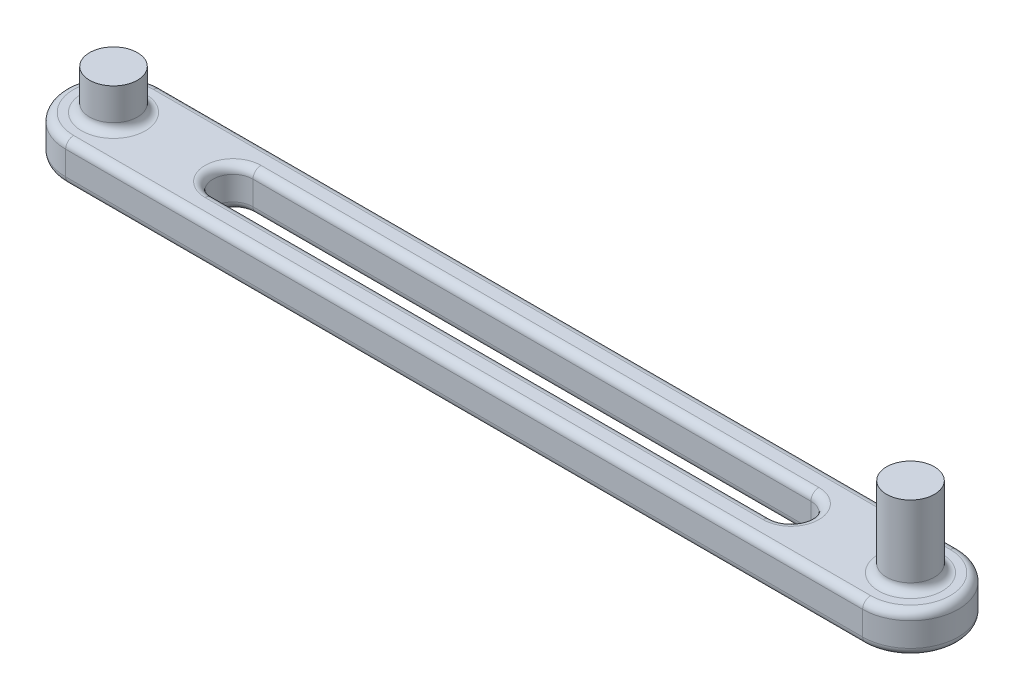
ISO-10303-21;
HEADER;
FILE_DESCRIPTION(('STEP AP214'),'2;1');
FILE_NAME('part.step','',(''),(''),'','','');
FILE_SCHEMA(('AUTOMOTIVE_DESIGN { 1 0 10303 214 1 1 1 1 }'));
ENDSEC;
DATA;
#1=APPLICATION_CONTEXT('core data for automotive mechanical design processes');
#2=APPLICATION_PROTOCOL_DEFINITION('international standard','automotive_design',2000,#1);
#3=PRODUCT_CONTEXT('',#1,'mechanical');
#4=PRODUCT('Part','Part','',(#3));
#5=PRODUCT_RELATED_PRODUCT_CATEGORY('part','',(#4));
#6=PRODUCT_DEFINITION_FORMATION('','',#4);
#7=PRODUCT_DEFINITION_CONTEXT('part definition',#1,'design');
#8=PRODUCT_DEFINITION('design','',#6,#7);
#9=PRODUCT_DEFINITION_SHAPE('','',#8);
#10=(LENGTH_UNIT() NAMED_UNIT(*) SI_UNIT(.MILLI.,.METRE.));
#11=(NAMED_UNIT(*) PLANE_ANGLE_UNIT() SI_UNIT($,.RADIAN.));
#12=(NAMED_UNIT(*) SI_UNIT($,.STERADIAN.) SOLID_ANGLE_UNIT());
#13=UNCERTAINTY_MEASURE_WITH_UNIT(LENGTH_MEASURE(1.E-05),#10,'distance_accuracy_value','');
#14=(GEOMETRIC_REPRESENTATION_CONTEXT(3) GLOBAL_UNCERTAINTY_ASSIGNED_CONTEXT((#13)) GLOBAL_UNIT_ASSIGNED_CONTEXT((#10,
#11,#12)) REPRESENTATION_CONTEXT('',''));
#15=CARTESIAN_POINT('',(0.,0.,0.));
#16=DIRECTION('',(0.,0.,1.));
#17=DIRECTION('',(1.,0.,0.));
#18=AXIS2_PLACEMENT_3D('',#15,#16,#17);
#19=CARTESIAN_POINT('',(-35.,0.,0.));
#20=DIRECTION('',(0.,1.,0.));
#21=DIRECTION('',(0.,0.,1.));
#22=AXIS2_PLACEMENT_3D('',#19,#20,#21);
#23=CYLINDRICAL_SURFACE('',#22,2.5);
#24=DIRECTION('',(0.,1.,0.));
#25=VECTOR('',#24,1.);
#26=CARTESIAN_POINT('',(-35.,0.,2.5));
#27=LINE('',#26,#25);
#28=CARTESIAN_POINT('',(-35.,1.,2.5));
#29=VERTEX_POINT('',#28);
#30=CARTESIAN_POINT('',(-35.,4.,2.5));
#31=VERTEX_POINT('',#30);
#32=EDGE_CURVE('E324',#29,#31,#27,.T.);
#33=ORIENTED_EDGE('',*,*,#32,.F.);
#34=CARTESIAN_POINT('',(-35.,1.,0.));
#35=DIRECTION('',(0.,1.,0.));
#36=DIRECTION('',(0.,0.,1.));
#37=AXIS2_PLACEMENT_3D('',#34,#35,#36);
#38=CIRCLE('',#37,2.5);
#39=CARTESIAN_POINT('',(-35.,1.,-2.5));
#40=VERTEX_POINT('',#39);
#41=EDGE_CURVE('E301',#29,#40,#38,.F.);
#42=ORIENTED_EDGE('',*,*,#41,.T.);
#43=DIRECTION('',(0.,1.,0.));
#44=VECTOR('',#43,1.);
#45=CARTESIAN_POINT('',(-35.,0.,-2.5));
#46=LINE('',#45,#44);
#47=CARTESIAN_POINT('',(-35.,4.,-2.5));
#48=VERTEX_POINT('',#47);
#49=EDGE_CURVE('E314',#40,#48,#46,.T.);
#50=ORIENTED_EDGE('',*,*,#49,.T.);
#51=CARTESIAN_POINT('',(-35.,4.,0.));
#52=DIRECTION('',(0.,1.,0.));
#53=DIRECTION('',(0.,0.,1.));
#54=AXIS2_PLACEMENT_3D('',#51,#52,#53);
#55=CIRCLE('',#54,2.5);
#56=EDGE_CURVE('E398',#48,#31,#55,.T.);
#57=ORIENTED_EDGE('',*,*,#56,.T.);
#58=EDGE_LOOP('',(#33,#42,#50,#57));
#59=FACE_BOUND('',#58,.T.);
#60=ADVANCED_FACE('F39',(#59),#23,.F.);
#61=CARTESIAN_POINT('',(-50.,5.,0.));
#62=DIRECTION('',(0.,-1.,0.));
#63=DIRECTION('',(0.,0.,-1.));
#64=AXIS2_PLACEMENT_3D('',#61,#62,#63);
#65=CYLINDRICAL_SURFACE('',#64,6.);
#66=DIRECTION('',(0.,-1.,0.));
#67=VECTOR('',#66,1.);
#68=CARTESIAN_POINT('',(-50.,5.,-5.99999999999999));
#69=LINE('',#68,#67);
#70=CARTESIAN_POINT('',(-50.,4.,-5.99999999999999));
#71=VERTEX_POINT('',#70);
#72=CARTESIAN_POINT('',(-50.,1.,-5.99999999999999));
#73=VERTEX_POINT('',#72);
#74=EDGE_CURVE('E322',#71,#73,#69,.T.);
#75=ORIENTED_EDGE('',*,*,#74,.T.);
#76=CARTESIAN_POINT('',(-50.,1.,0.));
#77=DIRECTION('',(0.,1.,0.));
#78=DIRECTION('',(0.,0.,1.));
#79=AXIS2_PLACEMENT_3D('',#76,#77,#78);
#80=CIRCLE('',#79,6.);
#81=CARTESIAN_POINT('',(-50.,1.,5.99999999999999));
#82=VERTEX_POINT('',#81);
#83=EDGE_CURVE('E177',#73,#82,#80,.T.);
#84=ORIENTED_EDGE('',*,*,#83,.T.);
#85=DIRECTION('',(0.,-1.,0.));
#86=VECTOR('',#85,1.);
#87=CARTESIAN_POINT('',(-50.,5.,5.99999999999999));
#88=LINE('',#87,#86);
#89=CARTESIAN_POINT('',(-50.,4.,5.99999999999999));
#90=VERTEX_POINT('',#89);
#91=EDGE_CURVE('E157',#90,#82,#88,.T.);
#92=ORIENTED_EDGE('',*,*,#91,.F.);
#93=CARTESIAN_POINT('',(-50.,4.,0.));
#94=DIRECTION('',(0.,1.,0.));
#95=DIRECTION('',(0.,0.,1.));
#96=AXIS2_PLACEMENT_3D('',#93,#94,#95);
#97=CIRCLE('',#96,6.);
#98=EDGE_CURVE('E174',#90,#71,#97,.F.);
#99=ORIENTED_EDGE('',*,*,#98,.T.);
#100=EDGE_LOOP('',(#75,#84,#92,#99));
#101=FACE_BOUND('',#100,.T.);
#102=ADVANCED_FACE('F173',(#101),#65,.T.);
#103=CARTESIAN_POINT('',(-50.,5.,0.));
#104=DIRECTION('',(0.,1.,0.));
#105=DIRECTION('',(0.,0.,1.));
#106=AXIS2_PLACEMENT_3D('',#103,#104,#105);
#107=PLANE('',#106);
#108=DIRECTION('',(-1.,0.,0.));
#109=VECTOR('',#108,1.);
#110=CARTESIAN_POINT('',(-50.,5.,-4.99999999999999));
#111=LINE('',#110,#109);
#112=CARTESIAN_POINT('',(50.,5.,-4.99999999999999));
#113=VERTEX_POINT('',#112);
#114=CARTESIAN_POINT('',(-50.,5.,-4.99999999999999));
#115=VERTEX_POINT('',#114);
#116=EDGE_CURVE('E49',#113,#115,#111,.T.);
#117=ORIENTED_EDGE('',*,*,#116,.T.);
#118=CARTESIAN_POINT('',(-50.,5.,0.));
#119=DIRECTION('',(0.,1.,0.));
#120=DIRECTION('',(0.,0.,1.));
#121=AXIS2_PLACEMENT_3D('',#118,#119,#120);
#122=CIRCLE('',#121,5.);
#123=CARTESIAN_POINT('',(-50.,5.,4.99999999999999));
#124=VERTEX_POINT('',#123);
#125=EDGE_CURVE('E11',#115,#124,#122,.T.);
#126=ORIENTED_EDGE('',*,*,#125,.T.);
#127=DIRECTION('',(1.,0.,0.));
#128=VECTOR('',#127,1.);
#129=CARTESIAN_POINT('',(50.,5.,4.99999999999999));
#130=LINE('',#129,#128);
#131=CARTESIAN_POINT('',(50.,5.,4.99999999999999));
#132=VERTEX_POINT('',#131);
#133=EDGE_CURVE('E192',#124,#132,#130,.T.);
#134=ORIENTED_EDGE('',*,*,#133,.T.);
#135=CARTESIAN_POINT('',(50.,5.,0.));
#136=DIRECTION('',(0.,1.,0.));
#137=DIRECTION('',(0.,0.,1.));
#138=AXIS2_PLACEMENT_3D('',#135,#136,#137);
#139=CIRCLE('',#138,4.99999999999999);
#140=EDGE_CURVE('E60',#132,#113,#139,.T.);
#141=ORIENTED_EDGE('',*,*,#140,.T.);
#142=EDGE_LOOP('',(#117,#126,#134,#141));
#143=FACE_BOUND('',#142,.T.);
#144=DIRECTION('',(1.,0.,0.));
#145=VECTOR('',#144,1.);
#146=CARTESIAN_POINT('',(-35.,5.,3.5));
#147=LINE('',#146,#145);
#148=CARTESIAN_POINT('',(35.,5.,3.5));
#149=VERTEX_POINT('',#148);
#150=CARTESIAN_POINT('',(-35.,5.,3.5));
#151=VERTEX_POINT('',#150);
#152=EDGE_CURVE('E227',#149,#151,#147,.F.);
#153=ORIENTED_EDGE('',*,*,#152,.T.);
#154=CARTESIAN_POINT('',(-35.,5.,0.));
#155=DIRECTION('',(0.,1.,0.));
#156=DIRECTION('',(0.,0.,1.));
#157=AXIS2_PLACEMENT_3D('',#154,#155,#156);
#158=CIRCLE('',#157,3.5);
#159=CARTESIAN_POINT('',(-35.,5.,-3.5));
#160=VERTEX_POINT('',#159);
#161=EDGE_CURVE('E257',#151,#160,#158,.F.);
#162=ORIENTED_EDGE('',*,*,#161,.T.);
#163=DIRECTION('',(-1.,0.,0.));
#164=VECTOR('',#163,1.);
#165=CARTESIAN_POINT('',(35.,5.,-3.5));
#166=LINE('',#165,#164);
#167=CARTESIAN_POINT('',(35.,5.,-3.5));
#168=VERTEX_POINT('',#167);
#169=EDGE_CURVE('E245',#160,#168,#166,.F.);
#170=ORIENTED_EDGE('',*,*,#169,.T.);
#171=CARTESIAN_POINT('',(35.,5.,0.));
#172=DIRECTION('',(0.,1.,0.));
#173=DIRECTION('',(0.,0.,1.));
#174=AXIS2_PLACEMENT_3D('',#171,#172,#173);
#175=CIRCLE('',#174,3.5);
#176=EDGE_CURVE('E232',#168,#149,#175,.F.);
#177=ORIENTED_EDGE('',*,*,#176,.T.);
#178=EDGE_LOOP('',(#153,#162,#170,#177));
#179=FACE_BOUND('',#178,.T.);
#180=CARTESIAN_POINT('',(-50.,5.,0.));
#181=DIRECTION('',(0.,1.,0.));
#182=DIRECTION('',(0.,0.,1.));
#183=AXIS2_PLACEMENT_3D('',#180,#181,#182);
#184=CIRCLE('',#183,4.);
#185=CARTESIAN_POINT('',(-50.,5.,4.));
#186=VERTEX_POINT('',#185);
#187=EDGE_CURVE('E347',#186,#186,#184,.F.);
#188=ORIENTED_EDGE('',*,*,#187,.T.);
#189=EDGE_LOOP('',(#188));
#190=FACE_BOUND('',#189,.T.);
#191=CARTESIAN_POINT('',(50.,5.,0.));
#192=DIRECTION('',(0.,1.,0.));
#193=DIRECTION('',(0.,0.,1.));
#194=AXIS2_PLACEMENT_3D('',#191,#192,#193);
#195=CIRCLE('',#194,4.);
#196=CARTESIAN_POINT('',(50.,5.,4.));
#197=VERTEX_POINT('',#196);
#198=EDGE_CURVE('E343',#197,#197,#195,.F.);
#199=ORIENTED_EDGE('',*,*,#198,.T.);
#200=EDGE_LOOP('',(#199));
#201=FACE_BOUND('',#200,.T.);
#202=ADVANCED_FACE('F414',(#143,#179,#190,#201),#107,.T.);
#203=CARTESIAN_POINT('',(-50.,0.,0.));
#204=DIRECTION('',(0.,1.,0.));
#205=DIRECTION('',(0.,0.,1.));
#206=AXIS2_PLACEMENT_3D('',#203,#204,#205);
#207=PLANE('',#206);
#208=DIRECTION('',(1.,0.,0.));
#209=VECTOR('',#208,1.);
#210=CARTESIAN_POINT('',(-50.,0.,4.99999999999999));
#211=LINE('',#210,#209);
#212=CARTESIAN_POINT('',(50.,0.,4.99999999999999));
#213=VERTEX_POINT('',#212);
#214=CARTESIAN_POINT('',(-50.,0.,4.99999999999999));
#215=VERTEX_POINT('',#214);
#216=EDGE_CURVE('E373',#213,#215,#211,.F.);
#217=ORIENTED_EDGE('',*,*,#216,.T.);
#218=CARTESIAN_POINT('',(-50.,0.,0.));
#219=DIRECTION('',(0.,1.,0.));
#220=DIRECTION('',(0.,0.,1.));
#221=AXIS2_PLACEMENT_3D('',#218,#219,#220);
#222=CIRCLE('',#221,5.);
#223=CARTESIAN_POINT('',(-50.,0.,-4.99999999999999));
#224=VERTEX_POINT('',#223);
#225=EDGE_CURVE('E166',#215,#224,#222,.F.);
#226=ORIENTED_EDGE('',*,*,#225,.T.);
#227=DIRECTION('',(-1.,0.,0.));
#228=VECTOR('',#227,1.);
#229=CARTESIAN_POINT('',(-50.,0.,-4.99999999999999));
#230=LINE('',#229,#228);
#231=CARTESIAN_POINT('',(50.,0.,-4.99999999999999));
#232=VERTEX_POINT('',#231);
#233=EDGE_CURVE('E367',#224,#232,#230,.F.);
#234=ORIENTED_EDGE('',*,*,#233,.T.);
#235=CARTESIAN_POINT('',(50.,0.,0.));
#236=DIRECTION('',(0.,1.,0.));
#237=DIRECTION('',(0.,0.,1.));
#238=AXIS2_PLACEMENT_3D('',#235,#236,#237);
#239=CIRCLE('',#238,4.99999999999999);
#240=EDGE_CURVE('E370',#232,#213,#239,.F.);
#241=ORIENTED_EDGE('',*,*,#240,.T.);
#242=EDGE_LOOP('',(#217,#226,#234,#241));
#243=FACE_BOUND('',#242,.T.);
#244=CARTESIAN_POINT('',(-35.,0.,0.));
#245=DIRECTION('',(0.,1.,0.));
#246=DIRECTION('',(0.,0.,1.));
#247=AXIS2_PLACEMENT_3D('',#244,#245,#246);
#248=CIRCLE('',#247,3.5);
#249=CARTESIAN_POINT('',(-35.,0.,-3.5));
#250=VERTEX_POINT('',#249);
#251=CARTESIAN_POINT('',(-35.,0.,3.5));
#252=VERTEX_POINT('',#251);
#253=EDGE_CURVE('E303',#250,#252,#248,.T.);
#254=ORIENTED_EDGE('',*,*,#253,.T.);
#255=DIRECTION('',(1.,0.,0.));
#256=VECTOR('',#255,1.);
#257=CARTESIAN_POINT('',(-50.,0.,3.5));
#258=LINE('',#257,#256);
#259=CARTESIAN_POINT('',(35.,0.,3.5));
#260=VERTEX_POINT('',#259);
#261=EDGE_CURVE('E363',#252,#260,#258,.T.);
#262=ORIENTED_EDGE('',*,*,#261,.T.);
#263=CARTESIAN_POINT('',(35.,0.,0.));
#264=DIRECTION('',(0.,1.,0.));
#265=DIRECTION('',(0.,0.,1.));
#266=AXIS2_PLACEMENT_3D('',#263,#264,#265);
#267=CIRCLE('',#266,3.5);
#268=CARTESIAN_POINT('',(35.,0.,-3.5));
#269=VERTEX_POINT('',#268);
#270=EDGE_CURVE('E356',#260,#269,#267,.T.);
#271=ORIENTED_EDGE('',*,*,#270,.T.);
#272=DIRECTION('',(-1.,0.,0.));
#273=VECTOR('',#272,1.);
#274=CARTESIAN_POINT('',(-50.,0.,-3.5));
#275=LINE('',#274,#273);
#276=EDGE_CURVE('E308',#269,#250,#275,.T.);
#277=ORIENTED_EDGE('',*,*,#276,.T.);
#278=EDGE_LOOP('',(#254,#262,#271,#277));
#279=FACE_BOUND('',#278,.T.);
#280=ADVANCED_FACE('F417',(#243,#279),#207,.F.);
#281=CARTESIAN_POINT('',(50.,5.,5.99999999999999));
#282=DIRECTION('',(0.,0.,-1.));
#283=DIRECTION('',(-1.,0.,0.));
#284=AXIS2_PLACEMENT_3D('',#281,#282,#283);
#285=PLANE('',#284);
#286=ORIENTED_EDGE('',*,*,#91,.T.);
#287=DIRECTION('',(1.,0.,0.));
#288=VECTOR('',#287,1.);
#289=CARTESIAN_POINT('',(50.,1.,5.99999999999999));
#290=LINE('',#289,#288);
#291=CARTESIAN_POINT('',(50.,1.,5.99999999999999));
#292=VERTEX_POINT('',#291);
#293=EDGE_CURVE('E165',#82,#292,#290,.T.);
#294=ORIENTED_EDGE('',*,*,#293,.T.);
#295=DIRECTION('',(0.,-1.,0.));
#296=VECTOR('',#295,1.);
#297=CARTESIAN_POINT('',(50.,5.,5.99999999999999));
#298=LINE('',#297,#296);
#299=CARTESIAN_POINT('',(50.,4.,5.99999999999999));
#300=VERTEX_POINT('',#299);
#301=EDGE_CURVE('E159',#300,#292,#298,.T.);
#302=ORIENTED_EDGE('',*,*,#301,.F.);
#303=DIRECTION('',(1.,0.,0.));
#304=VECTOR('',#303,1.);
#305=CARTESIAN_POINT('',(-50.,4.,5.99999999999999));
#306=LINE('',#305,#304);
#307=EDGE_CURVE('E154',#300,#90,#306,.F.);
#308=ORIENTED_EDGE('',*,*,#307,.T.);
#309=EDGE_LOOP('',(#286,#294,#302,#308));
#310=FACE_BOUND('',#309,.T.);
#311=ADVANCED_FACE('F156',(#310),#285,.F.);
#312=CARTESIAN_POINT('',(-50.,5.,-5.99999999999999));
#313=DIRECTION('',(0.,0.,1.));
#314=DIRECTION('',(1.,0.,0.));
#315=AXIS2_PLACEMENT_3D('',#312,#313,#314);
#316=PLANE('',#315);
#317=DIRECTION('',(0.,-1.,0.));
#318=VECTOR('',#317,1.);
#319=CARTESIAN_POINT('',(50.,5.,-5.99999999999999));
#320=LINE('',#319,#318);
#321=CARTESIAN_POINT('',(50.,4.,-5.99999999999999));
#322=VERTEX_POINT('',#321);
#323=CARTESIAN_POINT('',(50.,1.,-5.99999999999999));
#324=VERTEX_POINT('',#323);
#325=EDGE_CURVE('E334',#322,#324,#320,.T.);
#326=ORIENTED_EDGE('',*,*,#325,.T.);
#327=DIRECTION('',(-1.,0.,0.));
#328=VECTOR('',#327,1.);
#329=CARTESIAN_POINT('',(-50.,1.,-5.99999999999999));
#330=LINE('',#329,#328);
#331=EDGE_CURVE('E390',#324,#73,#330,.T.);
#332=ORIENTED_EDGE('',*,*,#331,.T.);
#333=ORIENTED_EDGE('',*,*,#74,.F.);
#334=DIRECTION('',(-1.,0.,0.));
#335=VECTOR('',#334,1.);
#336=CARTESIAN_POINT('',(50.,4.,-5.99999999999999));
#337=LINE('',#336,#335);
#338=EDGE_CURVE('E387',#71,#322,#337,.F.);
#339=ORIENTED_EDGE('',*,*,#338,.T.);
#340=EDGE_LOOP('',(#326,#332,#333,#339));
#341=FACE_BOUND('',#340,.T.);
#342=ADVANCED_FACE('F471',(#341),#316,.F.);
#343=CARTESIAN_POINT('',(50.,5.,0.));
#344=DIRECTION('',(0.,-1.,0.));
#345=DIRECTION('',(0.,0.,-1.));
#346=AXIS2_PLACEMENT_3D('',#343,#344,#345);
#347=CYLINDRICAL_SURFACE('',#346,5.99999999999999);
#348=ORIENTED_EDGE('',*,*,#301,.T.);
#349=CARTESIAN_POINT('',(50.,1.,0.));
#350=DIRECTION('',(0.,1.,0.));
#351=DIRECTION('',(0.,0.,1.));
#352=AXIS2_PLACEMENT_3D('',#349,#350,#351);
#353=CIRCLE('',#352,5.99999999999999);
#354=EDGE_CURVE('E384',#292,#324,#353,.T.);
#355=ORIENTED_EDGE('',*,*,#354,.T.);
#356=ORIENTED_EDGE('',*,*,#325,.F.);
#357=CARTESIAN_POINT('',(50.,4.,0.));
#358=DIRECTION('',(0.,1.,0.));
#359=DIRECTION('',(0.,0.,1.));
#360=AXIS2_PLACEMENT_3D('',#357,#358,#359);
#361=CIRCLE('',#360,5.99999999999999);
#362=EDGE_CURVE('E381',#322,#300,#361,.F.);
#363=ORIENTED_EDGE('',*,*,#362,.T.);
#364=EDGE_LOOP('',(#348,#355,#356,#363));
#365=FACE_BOUND('',#364,.T.);
#366=ADVANCED_FACE('F468',(#365),#347,.T.);
#367=CARTESIAN_POINT('',(35.,0.,0.));
#368=DIRECTION('',(0.,1.,0.));
#369=DIRECTION('',(0.,0.,1.));
#370=AXIS2_PLACEMENT_3D('',#367,#368,#369);
#371=CYLINDRICAL_SURFACE('',#370,2.5);
#372=DIRECTION('',(0.,1.,0.));
#373=VECTOR('',#372,1.);
#374=CARTESIAN_POINT('',(35.,0.,-2.5));
#375=LINE('',#374,#373);
#376=CARTESIAN_POINT('',(35.,1.,-2.5));
#377=VERTEX_POINT('',#376);
#378=CARTESIAN_POINT('',(35.,4.,-2.5));
#379=VERTEX_POINT('',#378);
#380=EDGE_CURVE('E312',#377,#379,#375,.T.);
#381=ORIENTED_EDGE('',*,*,#380,.F.);
#382=CARTESIAN_POINT('',(35.,1.,0.));
#383=DIRECTION('',(0.,1.,0.));
#384=DIRECTION('',(0.,0.,1.));
#385=AXIS2_PLACEMENT_3D('',#382,#383,#384);
#386=CIRCLE('',#385,2.5);
#387=CARTESIAN_POINT('',(35.,1.,2.5));
#388=VERTEX_POINT('',#387);
#389=EDGE_CURVE('E240',#377,#388,#386,.F.);
#390=ORIENTED_EDGE('',*,*,#389,.T.);
#391=DIRECTION('',(0.,1.,0.));
#392=VECTOR('',#391,1.);
#393=CARTESIAN_POINT('',(35.,0.,2.5));
#394=LINE('',#393,#392);
#395=CARTESIAN_POINT('',(35.,4.,2.5));
#396=VERTEX_POINT('',#395);
#397=EDGE_CURVE('E318',#388,#396,#394,.T.);
#398=ORIENTED_EDGE('',*,*,#397,.T.);
#399=CARTESIAN_POINT('',(35.,4.,0.));
#400=DIRECTION('',(0.,1.,0.));
#401=DIRECTION('',(0.,0.,1.));
#402=AXIS2_PLACEMENT_3D('',#399,#400,#401);
#403=CIRCLE('',#402,2.5);
#404=EDGE_CURVE('E233',#396,#379,#403,.T.);
#405=ORIENTED_EDGE('',*,*,#404,.T.);
#406=EDGE_LOOP('',(#381,#390,#398,#405));
#407=FACE_BOUND('',#406,.T.);
#408=ADVANCED_FACE('F315',(#407),#371,.F.);
#409=CARTESIAN_POINT('',(35.,0.,2.5));
#410=DIRECTION('',(0.,0.,1.));
#411=DIRECTION('',(1.,0.,0.));
#412=AXIS2_PLACEMENT_3D('',#409,#410,#411);
#413=PLANE('',#412);
#414=ORIENTED_EDGE('',*,*,#397,.F.);
#415=DIRECTION('',(1.,0.,0.));
#416=VECTOR('',#415,1.);
#417=CARTESIAN_POINT('',(35.,1.,2.5));
#418=LINE('',#417,#416);
#419=EDGE_CURVE('E395',#388,#29,#418,.F.);
#420=ORIENTED_EDGE('',*,*,#419,.T.);
#421=ORIENTED_EDGE('',*,*,#32,.T.);
#422=DIRECTION('',(1.,0.,0.));
#423=VECTOR('',#422,1.);
#424=CARTESIAN_POINT('',(35.,4.,2.5));
#425=LINE('',#424,#423);
#426=EDGE_CURVE('E225',#31,#396,#425,.T.);
#427=ORIENTED_EDGE('',*,*,#426,.T.);
#428=EDGE_LOOP('',(#414,#420,#421,#427));
#429=FACE_BOUND('',#428,.T.);
#430=ADVANCED_FACE('F456',(#429),#413,.F.);
#431=CARTESIAN_POINT('',(-35.,0.,-2.5));
#432=DIRECTION('',(0.,0.,-1.));
#433=DIRECTION('',(-1.,0.,0.));
#434=AXIS2_PLACEMENT_3D('',#431,#432,#433);
#435=PLANE('',#434);
#436=ORIENTED_EDGE('',*,*,#49,.F.);
#437=DIRECTION('',(-1.,0.,0.));
#438=VECTOR('',#437,1.);
#439=CARTESIAN_POINT('',(-35.,1.,-2.5));
#440=LINE('',#439,#438);
#441=EDGE_CURVE('E241',#40,#377,#440,.F.);
#442=ORIENTED_EDGE('',*,*,#441,.T.);
#443=ORIENTED_EDGE('',*,*,#380,.T.);
#444=DIRECTION('',(-1.,0.,0.));
#445=VECTOR('',#444,1.);
#446=CARTESIAN_POINT('',(-35.,4.,-2.5));
#447=LINE('',#446,#445);
#448=EDGE_CURVE('E247',#379,#48,#447,.T.);
#449=ORIENTED_EDGE('',*,*,#448,.T.);
#450=EDGE_LOOP('',(#436,#442,#443,#449));
#451=FACE_BOUND('',#450,.T.);
#452=ADVANCED_FACE('F311',(#451),#435,.F.);
#453=CARTESIAN_POINT('',(-50.,10.,0.));
#454=DIRECTION('',(0.,-1.,0.));
#455=DIRECTION('',(0.,0.,-1.));
#456=AXIS2_PLACEMENT_3D('',#453,#454,#455);
#457=CYLINDRICAL_SURFACE('',#456,3.);
#458=CARTESIAN_POINT('',(-50.,6.,0.));
#459=DIRECTION('',(0.,1.,0.));
#460=DIRECTION('',(0.,0.,1.));
#461=AXIS2_PLACEMENT_3D('',#458,#459,#460);
#462=CIRCLE('',#461,3.);
#463=CARTESIAN_POINT('',(-50.,6.,3.));
#464=VERTEX_POINT('',#463);
#465=EDGE_CURVE('E179',#464,#464,#462,.T.);
#466=ORIENTED_EDGE('',*,*,#465,.T.);
#467=EDGE_LOOP('',(#466));
#468=FACE_BOUND('',#467,.T.);
#469=CARTESIAN_POINT('',(-50.,10.,0.));
#470=DIRECTION('',(0.,1.,0.));
#471=DIRECTION('',(0.,0.,1.));
#472=AXIS2_PLACEMENT_3D('',#469,#470,#471);
#473=CIRCLE('',#472,3.);
#474=CARTESIAN_POINT('',(-50.,10.,3.));
#475=VERTEX_POINT('',#474);
#476=EDGE_CURVE('E331',#475,#475,#473,.T.);
#477=ORIENTED_EDGE('',*,*,#476,.F.);
#478=EDGE_LOOP('',(#477));
#479=FACE_BOUND('',#478,.T.);
#480=ADVANCED_FACE('F447',(#468,#479),#457,.T.);
#481=CARTESIAN_POINT('',(-50.,10.,0.));
#482=DIRECTION('',(0.,1.,0.));
#483=DIRECTION('',(0.,0.,1.));
#484=AXIS2_PLACEMENT_3D('',#481,#482,#483);
#485=PLANE('',#484);
#486=ORIENTED_EDGE('',*,*,#476,.T.);
#487=EDGE_LOOP('',(#486));
#488=FACE_BOUND('',#487,.T.);
#489=ADVANCED_FACE('F435',(#488),#485,.T.);
#490=CARTESIAN_POINT('',(50.,15.,0.));
#491=DIRECTION('',(0.,-1.,0.));
#492=DIRECTION('',(0.,0.,-1.));
#493=AXIS2_PLACEMENT_3D('',#490,#491,#492);
#494=CYLINDRICAL_SURFACE('',#493,3.);
#495=CARTESIAN_POINT('',(50.,6.,0.));
#496=DIRECTION('',(0.,1.,0.));
#497=DIRECTION('',(0.,0.,1.));
#498=AXIS2_PLACEMENT_3D('',#495,#496,#497);
#499=CIRCLE('',#498,3.);
#500=CARTESIAN_POINT('',(50.,6.,3.));
#501=VERTEX_POINT('',#500);
#502=EDGE_CURVE('E189',#501,#501,#499,.T.);
#503=ORIENTED_EDGE('',*,*,#502,.T.);
#504=EDGE_LOOP('',(#503));
#505=FACE_BOUND('',#504,.T.);
#506=CARTESIAN_POINT('',(50.,15.,0.));
#507=DIRECTION('',(0.,1.,0.));
#508=DIRECTION('',(0.,0.,1.));
#509=AXIS2_PLACEMENT_3D('',#506,#507,#508);
#510=CIRCLE('',#509,3.);
#511=CARTESIAN_POINT('',(50.,15.,3.));
#512=VERTEX_POINT('',#511);
#513=EDGE_CURVE('E281',#512,#512,#510,.T.);
#514=ORIENTED_EDGE('',*,*,#513,.F.);
#515=EDGE_LOOP('',(#514));
#516=FACE_BOUND('',#515,.T.);
#517=ADVANCED_FACE('F431',(#505,#516),#494,.T.);
#518=CARTESIAN_POINT('',(50.,15.,0.));
#519=DIRECTION('',(0.,1.,0.));
#520=DIRECTION('',(0.,0.,1.));
#521=AXIS2_PLACEMENT_3D('',#518,#519,#520);
#522=PLANE('',#521);
#523=ORIENTED_EDGE('',*,*,#513,.T.);
#524=EDGE_LOOP('',(#523));
#525=FACE_BOUND('',#524,.T.);
#526=ADVANCED_FACE('F434',(#525),#522,.T.);
#527=CARTESIAN_POINT('',(-50.,6.,0.));
#528=DIRECTION('',(0.,1.,0.));
#529=DIRECTION('',(0.,0.,1.));
#530=AXIS2_PLACEMENT_3D('',#527,#528,#529);
#531=TOROIDAL_SURFACE('',#530,4.,1.);
#532=ORIENTED_EDGE('',*,*,#187,.F.);
#533=EDGE_LOOP('',(#532));
#534=FACE_BOUND('',#533,.T.);
#535=ORIENTED_EDGE('',*,*,#465,.F.);
#536=EDGE_LOOP('',(#535));
#537=FACE_BOUND('',#536,.T.);
#538=ADVANCED_FACE('F427',(#534,#537),#531,.F.);
#539=CARTESIAN_POINT('',(50.,6.,0.));
#540=DIRECTION('',(0.,1.,0.));
#541=DIRECTION('',(0.,0.,1.));
#542=AXIS2_PLACEMENT_3D('',#539,#540,#541);
#543=TOROIDAL_SURFACE('',#542,4.,1.);
#544=ORIENTED_EDGE('',*,*,#198,.F.);
#545=EDGE_LOOP('',(#544));
#546=FACE_BOUND('',#545,.T.);
#547=ORIENTED_EDGE('',*,*,#502,.F.);
#548=EDGE_LOOP('',(#547));
#549=FACE_BOUND('',#548,.T.);
#550=ADVANCED_FACE('F423',(#546,#549),#543,.F.);
#551=CARTESIAN_POINT('',(50.,1.,0.));
#552=DIRECTION('',(0.,1.,0.));
#553=DIRECTION('',(0.,0.,1.));
#554=AXIS2_PLACEMENT_3D('',#551,#552,#553);
#555=TOROIDAL_SURFACE('',#554,4.99999999999999,1.);
#556=CARTESIAN_POINT('',(50.,1.,4.99999999999999));
#557=DIRECTION('',(-1.,0.,0.));
#558=DIRECTION('',(0.,0.,1.));
#559=AXIS2_PLACEMENT_3D('',#556,#557,#558);
#560=CIRCLE('',#559,1.);
#561=EDGE_CURVE('E273',#213,#292,#560,.T.);
#562=ORIENTED_EDGE('',*,*,#561,.F.);
#563=ORIENTED_EDGE('',*,*,#240,.F.);
#564=CARTESIAN_POINT('',(50.,1.,-4.99999999999999));
#565=DIRECTION('',(-1.,0.,0.));
#566=DIRECTION('',(0.,0.,1.));
#567=AXIS2_PLACEMENT_3D('',#564,#565,#566);
#568=CIRCLE('',#567,1.);
#569=EDGE_CURVE('E277',#324,#232,#568,.T.);
#570=ORIENTED_EDGE('',*,*,#569,.F.);
#571=ORIENTED_EDGE('',*,*,#354,.F.);
#572=EDGE_LOOP('',(#562,#563,#570,#571));
#573=FACE_BOUND('',#572,.T.);
#574=ADVANCED_FACE('F426',(#573),#555,.T.);
#575=CARTESIAN_POINT('',(-50.,1.,-4.99999999999999));
#576=DIRECTION('',(-1.,0.,0.));
#577=DIRECTION('',(0.,0.,1.));
#578=AXIS2_PLACEMENT_3D('',#575,#576,#577);
#579=CYLINDRICAL_SURFACE('',#578,1.);
#580=ORIENTED_EDGE('',*,*,#569,.T.);
#581=ORIENTED_EDGE('',*,*,#233,.F.);
#582=CARTESIAN_POINT('',(-50.,1.,-4.99999999999999));
#583=DIRECTION('',(-1.,0.,0.));
#584=DIRECTION('',(0.,0.,1.));
#585=AXIS2_PLACEMENT_3D('',#582,#583,#584);
#586=CIRCLE('',#585,1.);
#587=EDGE_CURVE('E270',#73,#224,#586,.T.);
#588=ORIENTED_EDGE('',*,*,#587,.F.);
#589=ORIENTED_EDGE('',*,*,#331,.F.);
#590=EDGE_LOOP('',(#580,#581,#588,#589));
#591=FACE_BOUND('',#590,.T.);
#592=ADVANCED_FACE('F491',(#591),#579,.T.);
#593=CARTESIAN_POINT('',(50.,1.,4.99999999999999));
#594=DIRECTION('',(1.,0.,0.));
#595=DIRECTION('',(0.,0.,-1.));
#596=AXIS2_PLACEMENT_3D('',#593,#594,#595);
#597=CYLINDRICAL_SURFACE('',#596,1.);
#598=ORIENTED_EDGE('',*,*,#561,.T.);
#599=ORIENTED_EDGE('',*,*,#293,.F.);
#600=CARTESIAN_POINT('',(-50.,1.,4.99999999999999));
#601=DIRECTION('',(-1.,0.,0.));
#602=DIRECTION('',(0.,0.,1.));
#603=AXIS2_PLACEMENT_3D('',#600,#601,#602);
#604=CIRCLE('',#603,1.);
#605=EDGE_CURVE('E267',#215,#82,#604,.T.);
#606=ORIENTED_EDGE('',*,*,#605,.F.);
#607=ORIENTED_EDGE('',*,*,#216,.F.);
#608=EDGE_LOOP('',(#598,#599,#606,#607));
#609=FACE_BOUND('',#608,.T.);
#610=ADVANCED_FACE('F487',(#609),#597,.T.);
#611=CARTESIAN_POINT('',(-50.,1.,0.));
#612=DIRECTION('',(0.,1.,0.));
#613=DIRECTION('',(0.,0.,1.));
#614=AXIS2_PLACEMENT_3D('',#611,#612,#613);
#615=TOROIDAL_SURFACE('',#614,5.,1.);
#616=ORIENTED_EDGE('',*,*,#587,.T.);
#617=ORIENTED_EDGE('',*,*,#225,.F.);
#618=ORIENTED_EDGE('',*,*,#605,.T.);
#619=ORIENTED_EDGE('',*,*,#83,.F.);
#620=EDGE_LOOP('',(#616,#617,#618,#619));
#621=FACE_BOUND('',#620,.T.);
#622=ADVANCED_FACE('F484',(#621),#615,.T.);
#623=CARTESIAN_POINT('',(-50.,1.,-3.5));
#624=DIRECTION('',(-1.,0.,0.));
#625=DIRECTION('',(0.,0.,1.));
#626=AXIS2_PLACEMENT_3D('',#623,#624,#625);
#627=CYLINDRICAL_SURFACE('',#626,1.);
#628=CARTESIAN_POINT('',(35.,1.,-3.5));
#629=DIRECTION('',(1.,0.,0.));
#630=DIRECTION('',(0.,0.,-1.));
#631=AXIS2_PLACEMENT_3D('',#628,#629,#630);
#632=CIRCLE('',#631,1.);
#633=EDGE_CURVE('E286',#377,#269,#632,.T.);
#634=ORIENTED_EDGE('',*,*,#633,.F.);
#635=ORIENTED_EDGE('',*,*,#441,.F.);
#636=CARTESIAN_POINT('',(-35.,1.,-3.5));
#637=DIRECTION('',(-1.,0.,0.));
#638=DIRECTION('',(0.,0.,1.));
#639=AXIS2_PLACEMENT_3D('',#636,#637,#638);
#640=CIRCLE('',#639,1.);
#641=EDGE_CURVE('E202',#250,#40,#640,.T.);
#642=ORIENTED_EDGE('',*,*,#641,.F.);
#643=ORIENTED_EDGE('',*,*,#276,.F.);
#644=EDGE_LOOP('',(#634,#635,#642,#643));
#645=FACE_BOUND('',#644,.T.);
#646=ADVANCED_FACE('F307',(#645),#627,.T.);
#647=CARTESIAN_POINT('',(-35.,1.,0.));
#648=DIRECTION('',(0.,1.,0.));
#649=DIRECTION('',(0.,0.,1.));
#650=AXIS2_PLACEMENT_3D('',#647,#648,#649);
#651=TOROIDAL_SURFACE('',#650,3.5,1.);
#652=ORIENTED_EDGE('',*,*,#641,.T.);
#653=ORIENTED_EDGE('',*,*,#41,.F.);
#654=CARTESIAN_POINT('',(-35.,1.,3.5));
#655=DIRECTION('',(1.,0.,0.));
#656=DIRECTION('',(0.,0.,-1.));
#657=AXIS2_PLACEMENT_3D('',#654,#655,#656);
#658=CIRCLE('',#657,1.);
#659=EDGE_CURVE('E284',#252,#29,#658,.T.);
#660=ORIENTED_EDGE('',*,*,#659,.F.);
#661=ORIENTED_EDGE('',*,*,#253,.F.);
#662=EDGE_LOOP('',(#652,#653,#660,#661));
#663=FACE_BOUND('',#662,.T.);
#664=ADVANCED_FACE('F299',(#663),#651,.T.);
#665=CARTESIAN_POINT('',(35.,1.,0.));
#666=DIRECTION('',(0.,1.,0.));
#667=DIRECTION('',(0.,0.,1.));
#668=AXIS2_PLACEMENT_3D('',#665,#666,#667);
#669=TOROIDAL_SURFACE('',#668,3.5,1.);
#670=ORIENTED_EDGE('',*,*,#633,.T.);
#671=ORIENTED_EDGE('',*,*,#270,.F.);
#672=CARTESIAN_POINT('',(35.,1.,3.5));
#673=DIRECTION('',(-1.,0.,0.));
#674=DIRECTION('',(0.,0.,1.));
#675=AXIS2_PLACEMENT_3D('',#672,#673,#674);
#676=CIRCLE('',#675,1.);
#677=EDGE_CURVE('E211',#388,#260,#676,.T.);
#678=ORIENTED_EDGE('',*,*,#677,.F.);
#679=ORIENTED_EDGE('',*,*,#389,.F.);
#680=EDGE_LOOP('',(#670,#671,#678,#679));
#681=FACE_BOUND('',#680,.T.);
#682=ADVANCED_FACE('F503',(#681),#669,.T.);
#683=CARTESIAN_POINT('',(-50.,1.,3.5));
#684=DIRECTION('',(1.,0.,0.));
#685=DIRECTION('',(0.,0.,-1.));
#686=AXIS2_PLACEMENT_3D('',#683,#684,#685);
#687=CYLINDRICAL_SURFACE('',#686,1.);
#688=ORIENTED_EDGE('',*,*,#659,.T.);
#689=ORIENTED_EDGE('',*,*,#419,.F.);
#690=ORIENTED_EDGE('',*,*,#677,.T.);
#691=ORIENTED_EDGE('',*,*,#261,.F.);
#692=EDGE_LOOP('',(#688,#689,#690,#691));
#693=FACE_BOUND('',#692,.T.);
#694=ADVANCED_FACE('F499',(#693),#687,.T.);
#695=CARTESIAN_POINT('',(50.,4.,0.));
#696=DIRECTION('',(0.,1.,0.));
#697=DIRECTION('',(0.,0.,1.));
#698=AXIS2_PLACEMENT_3D('',#695,#696,#697);
#699=TOROIDAL_SURFACE('',#698,4.99999999999999,1.);
#700=CARTESIAN_POINT('',(50.,4.,4.99999999999999));
#701=DIRECTION('',(-1.,0.,0.));
#702=DIRECTION('',(0.,0.,1.));
#703=AXIS2_PLACEMENT_3D('',#700,#701,#702);
#704=CIRCLE('',#703,1.);
#705=EDGE_CURVE('E197',#300,#132,#704,.T.);
#706=ORIENTED_EDGE('',*,*,#705,.F.);
#707=ORIENTED_EDGE('',*,*,#362,.F.);
#708=CARTESIAN_POINT('',(50.,4.,-4.99999999999999));
#709=DIRECTION('',(-1.,0.,0.));
#710=DIRECTION('',(0.,0.,1.));
#711=AXIS2_PLACEMENT_3D('',#708,#709,#710);
#712=CIRCLE('',#711,1.);
#713=EDGE_CURVE('E207',#113,#322,#712,.T.);
#714=ORIENTED_EDGE('',*,*,#713,.F.);
#715=ORIENTED_EDGE('',*,*,#140,.F.);
#716=EDGE_LOOP('',(#706,#707,#714,#715));
#717=FACE_BOUND('',#716,.T.);
#718=ADVANCED_FACE('F502',(#717),#699,.T.);
#719=CARTESIAN_POINT('',(-50.,4.,-4.99999999999999));
#720=DIRECTION('',(1.,0.,0.));
#721=DIRECTION('',(0.,0.,-1.));
#722=AXIS2_PLACEMENT_3D('',#719,#720,#721);
#723=CYLINDRICAL_SURFACE('',#722,1.);
#724=ORIENTED_EDGE('',*,*,#713,.T.);
#725=ORIENTED_EDGE('',*,*,#338,.F.);
#726=CARTESIAN_POINT('',(-50.,4.,-4.99999999999999));
#727=DIRECTION('',(-1.,0.,0.));
#728=DIRECTION('',(0.,0.,1.));
#729=AXIS2_PLACEMENT_3D('',#726,#727,#728);
#730=CIRCLE('',#729,1.);
#731=EDGE_CURVE('E186',#115,#71,#730,.T.);
#732=ORIENTED_EDGE('',*,*,#731,.F.);
#733=ORIENTED_EDGE('',*,*,#116,.F.);
#734=EDGE_LOOP('',(#724,#725,#732,#733));
#735=FACE_BOUND('',#734,.T.);
#736=ADVANCED_FACE('F515',(#735),#723,.T.);
#737=CARTESIAN_POINT('',(-50.,4.,4.99999999999999));
#738=DIRECTION('',(-1.,0.,0.));
#739=DIRECTION('',(0.,0.,1.));
#740=AXIS2_PLACEMENT_3D('',#737,#738,#739);
#741=CYLINDRICAL_SURFACE('',#740,1.);
#742=ORIENTED_EDGE('',*,*,#705,.T.);
#743=ORIENTED_EDGE('',*,*,#133,.F.);
#744=CARTESIAN_POINT('',(-50.,4.,4.99999999999999));
#745=DIRECTION('',(-1.,0.,0.));
#746=DIRECTION('',(0.,0.,1.));
#747=AXIS2_PLACEMENT_3D('',#744,#745,#746);
#748=CIRCLE('',#747,1.);
#749=EDGE_CURVE('E184',#90,#124,#748,.T.);
#750=ORIENTED_EDGE('',*,*,#749,.F.);
#751=ORIENTED_EDGE('',*,*,#307,.F.);
#752=EDGE_LOOP('',(#742,#743,#750,#751));
#753=FACE_BOUND('',#752,.T.);
#754=ADVANCED_FACE('F191',(#753),#741,.T.);
#755=CARTESIAN_POINT('',(-50.,4.,0.));
#756=DIRECTION('',(0.,1.,0.));
#757=DIRECTION('',(0.,0.,1.));
#758=AXIS2_PLACEMENT_3D('',#755,#756,#757);
#759=TOROIDAL_SURFACE('',#758,5.,1.);
#760=ORIENTED_EDGE('',*,*,#731,.T.);
#761=ORIENTED_EDGE('',*,*,#98,.F.);
#762=ORIENTED_EDGE('',*,*,#749,.T.);
#763=ORIENTED_EDGE('',*,*,#125,.F.);
#764=EDGE_LOOP('',(#760,#761,#762,#763));
#765=FACE_BOUND('',#764,.T.);
#766=ADVANCED_FACE('F182',(#765),#759,.T.);
#767=CARTESIAN_POINT('',(35.,4.,0.));
#768=DIRECTION('',(0.,1.,0.));
#769=DIRECTION('',(0.,0.,1.));
#770=AXIS2_PLACEMENT_3D('',#767,#768,#769);
#771=TOROIDAL_SURFACE('',#770,3.5,1.);
#772=CARTESIAN_POINT('',(35.,4.,3.5));
#773=DIRECTION('',(-1.,0.,0.));
#774=DIRECTION('',(0.,0.,1.));
#775=AXIS2_PLACEMENT_3D('',#772,#773,#774);
#776=CIRCLE('',#775,1.);
#777=EDGE_CURVE('E200',#149,#396,#776,.T.);
#778=ORIENTED_EDGE('',*,*,#777,.F.);
#779=ORIENTED_EDGE('',*,*,#176,.F.);
#780=CARTESIAN_POINT('',(35.,4.,-3.5));
#781=DIRECTION('',(-1.,0.,0.));
#782=DIRECTION('',(0.,0.,1.));
#783=AXIS2_PLACEMENT_3D('',#780,#781,#782);
#784=CIRCLE('',#783,1.);
#785=EDGE_CURVE('E43',#379,#168,#784,.T.);
#786=ORIENTED_EDGE('',*,*,#785,.F.);
#787=ORIENTED_EDGE('',*,*,#404,.F.);
#788=EDGE_LOOP('',(#778,#779,#786,#787));
#789=FACE_BOUND('',#788,.T.);
#790=ADVANCED_FACE('F41',(#789),#771,.T.);
#791=CARTESIAN_POINT('',(-35.,4.,-3.5));
#792=DIRECTION('',(1.,0.,0.));
#793=DIRECTION('',(0.,0.,-1.));
#794=AXIS2_PLACEMENT_3D('',#791,#792,#793);
#795=CYLINDRICAL_SURFACE('',#794,1.);
#796=ORIENTED_EDGE('',*,*,#785,.T.);
#797=ORIENTED_EDGE('',*,*,#169,.F.);
#798=CARTESIAN_POINT('',(-35.,4.,-3.5));
#799=DIRECTION('',(-1.,0.,0.));
#800=DIRECTION('',(0.,0.,1.));
#801=AXIS2_PLACEMENT_3D('',#798,#799,#800);
#802=CIRCLE('',#801,1.);
#803=EDGE_CURVE('E215',#48,#160,#802,.T.);
#804=ORIENTED_EDGE('',*,*,#803,.F.);
#805=ORIENTED_EDGE('',*,*,#448,.F.);
#806=EDGE_LOOP('',(#796,#797,#804,#805));
#807=FACE_BOUND('',#806,.T.);
#808=ADVANCED_FACE('F409',(#807),#795,.T.);
#809=CARTESIAN_POINT('',(35.,4.,3.5));
#810=DIRECTION('',(-1.,0.,0.));
#811=DIRECTION('',(0.,0.,1.));
#812=AXIS2_PLACEMENT_3D('',#809,#810,#811);
#813=CYLINDRICAL_SURFACE('',#812,1.);
#814=ORIENTED_EDGE('',*,*,#777,.T.);
#815=ORIENTED_EDGE('',*,*,#426,.F.);
#816=CARTESIAN_POINT('',(-35.,4.,3.5));
#817=DIRECTION('',(-1.,0.,0.));
#818=DIRECTION('',(0.,0.,1.));
#819=AXIS2_PLACEMENT_3D('',#816,#817,#818);
#820=CIRCLE('',#819,1.);
#821=EDGE_CURVE('E212',#151,#31,#820,.T.);
#822=ORIENTED_EDGE('',*,*,#821,.F.);
#823=ORIENTED_EDGE('',*,*,#152,.F.);
#824=EDGE_LOOP('',(#814,#815,#822,#823));
#825=FACE_BOUND('',#824,.T.);
#826=ADVANCED_FACE('F223',(#825),#813,.T.);
#827=CARTESIAN_POINT('',(-35.,4.,0.));
#828=DIRECTION('',(0.,1.,0.));
#829=DIRECTION('',(0.,0.,1.));
#830=AXIS2_PLACEMENT_3D('',#827,#828,#829);
#831=TOROIDAL_SURFACE('',#830,3.5,1.);
#832=ORIENTED_EDGE('',*,*,#803,.T.);
#833=ORIENTED_EDGE('',*,*,#161,.F.);
#834=ORIENTED_EDGE('',*,*,#821,.T.);
#835=ORIENTED_EDGE('',*,*,#56,.F.);
#836=EDGE_LOOP('',(#832,#833,#834,#835));
#837=FACE_BOUND('',#836,.T.);
#838=ADVANCED_FACE('F412',(#837),#831,.T.);
#839=CLOSED_SHELL('',(#60,#102,#202,#280,#311,#342,#366,#408,#430,#452,#480,#489,#517,#526,#538,
#550,#574,#592,#610,#622,#646,#664,#682,#694,#718,#736,#754,#766,#790,#808,#826,#838));
#840=MANIFOLD_SOLID_BREP('B2',#839);
#841=ADVANCED_BREP_SHAPE_REPRESENTATION('',(#18,#840),#14);
#842=SHAPE_DEFINITION_REPRESENTATION(#9,#841);
ENDSEC;
END-ISO-10303-21;
